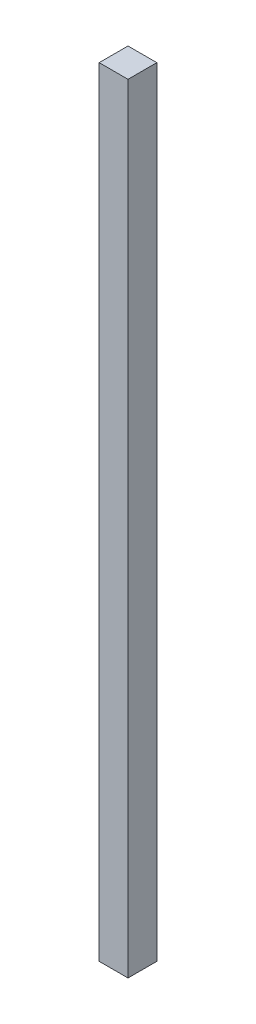
ISO-10303-21;
HEADER;
FILE_DESCRIPTION(('STEP AP214'),'2;1');
FILE_NAME('part.step','',(''),(''),'','','');
FILE_SCHEMA(('AUTOMOTIVE_DESIGN { 1 0 10303 214 1 1 1 1 }'));
ENDSEC;
DATA;
#1=APPLICATION_CONTEXT('core data for automotive mechanical design processes');
#2=APPLICATION_PROTOCOL_DEFINITION('international standard','automotive_design',2000,#1);
#3=PRODUCT_CONTEXT('',#1,'mechanical');
#4=PRODUCT('Part','Part','',(#3));
#5=PRODUCT_RELATED_PRODUCT_CATEGORY('part','',(#4));
#6=PRODUCT_DEFINITION_FORMATION('','',#4);
#7=PRODUCT_DEFINITION_CONTEXT('part definition',#1,'design');
#8=PRODUCT_DEFINITION('design','',#6,#7);
#9=PRODUCT_DEFINITION_SHAPE('','',#8);
#10=(LENGTH_UNIT() NAMED_UNIT(*) SI_UNIT(.MILLI.,.METRE.));
#11=(NAMED_UNIT(*) PLANE_ANGLE_UNIT() SI_UNIT($,.RADIAN.));
#12=(NAMED_UNIT(*) SI_UNIT($,.STERADIAN.) SOLID_ANGLE_UNIT());
#13=UNCERTAINTY_MEASURE_WITH_UNIT(LENGTH_MEASURE(1.E-05),#10,'distance_accuracy_value','');
#14=(GEOMETRIC_REPRESENTATION_CONTEXT(3) GLOBAL_UNCERTAINTY_ASSIGNED_CONTEXT((#13)) GLOBAL_UNIT_ASSIGNED_CONTEXT((#10,
#11,#12)) REPRESENTATION_CONTEXT('',''));
#15=CARTESIAN_POINT('',(0.,0.,0.));
#16=DIRECTION('',(0.,0.,1.));
#17=DIRECTION('',(1.,0.,0.));
#18=AXIS2_PLACEMENT_3D('',#15,#16,#17);
#19=CARTESIAN_POINT('',(0.,685.8,0.));
#20=DIRECTION('',(0.999999999999999,0.,0.));
#21=DIRECTION('',(0.,0.,-0.999999999999999));
#22=AXIS2_PLACEMENT_3D('',#19,#20,#21);
#23=PLANE('',#22);
#24=DIRECTION('',(0.,0.,0.999999999999999));
#25=VECTOR('',#24,1.);
#26=CARTESIAN_POINT('',(0.,0.,0.));
#27=LINE('',#26,#25);
#28=CARTESIAN_POINT('',(0.,8.88178419700125E-13,-25.3999999999994));
#29=VERTEX_POINT('',#28);
#30=CARTESIAN_POINT('',(0.,0.,0.));
#31=VERTEX_POINT('',#30);
#32=EDGE_CURVE('E97',#29,#31,#27,.T.);
#33=ORIENTED_EDGE('',*,*,#32,.T.);
#34=DIRECTION('',(0.,-0.999999999999999,0.));
#35=VECTOR('',#34,1.);
#36=CARTESIAN_POINT('',(0.,685.8,0.));
#37=LINE('',#36,#35);
#38=CARTESIAN_POINT('',(0.,685.8,0.));
#39=VERTEX_POINT('',#38);
#40=EDGE_CURVE('E11',#39,#31,#37,.T.);
#41=ORIENTED_EDGE('',*,*,#40,.F.);
#42=DIRECTION('',(0.,0.,0.999999999999999));
#43=VECTOR('',#42,1.);
#44=CARTESIAN_POINT('',(0.,685.8,0.));
#45=LINE('',#44,#43);
#46=CARTESIAN_POINT('',(0.,685.8,-25.3999999999999));
#47=VERTEX_POINT('',#46);
#48=EDGE_CURVE('E85',#47,#39,#45,.T.);
#49=ORIENTED_EDGE('',*,*,#48,.F.);
#50=DIRECTION('',(0.,-0.999999999999999,0.));
#51=VECTOR('',#50,1.);
#52=CARTESIAN_POINT('',(0.,685.8,-25.3999999999999));
#53=LINE('',#52,#51);
#54=EDGE_CURVE('E93',#47,#29,#53,.T.);
#55=ORIENTED_EDGE('',*,*,#54,.T.);
#56=EDGE_LOOP('',(#33,#41,#49,#55));
#57=FACE_BOUND('',#56,.T.);
#58=ADVANCED_FACE('F34',(#57),#23,.F.);
#59=CARTESIAN_POINT('',(0.,685.8,0.));
#60=DIRECTION('',(0.,0.,-0.999999999999999));
#61=DIRECTION('',(-0.999999999999999,0.,0.));
#62=AXIS2_PLACEMENT_3D('',#59,#60,#61);
#63=PLANE('',#62);
#64=DIRECTION('',(0.999999999999999,0.,0.));
#65=VECTOR('',#64,1.);
#66=CARTESIAN_POINT('',(0.,0.,0.));
#67=LINE('',#66,#65);
#68=CARTESIAN_POINT('',(25.4,0.,0.));
#69=VERTEX_POINT('',#68);
#70=EDGE_CURVE('E89',#31,#69,#67,.T.);
#71=ORIENTED_EDGE('',*,*,#70,.T.);
#72=DIRECTION('',(0.,-0.999999999999999,0.));
#73=VECTOR('',#72,1.);
#74=CARTESIAN_POINT('',(25.4,685.8,0.));
#75=LINE('',#74,#73);
#76=CARTESIAN_POINT('',(25.4,685.8,0.));
#77=VERTEX_POINT('',#76);
#78=EDGE_CURVE('E42',#77,#69,#75,.T.);
#79=ORIENTED_EDGE('',*,*,#78,.F.);
#80=DIRECTION('',(0.999999999999999,0.,0.));
#81=VECTOR('',#80,1.);
#82=CARTESIAN_POINT('',(0.,685.8,0.));
#83=LINE('',#82,#81);
#84=EDGE_CURVE('E80',#39,#77,#83,.T.);
#85=ORIENTED_EDGE('',*,*,#84,.F.);
#86=ORIENTED_EDGE('',*,*,#40,.T.);
#87=EDGE_LOOP('',(#71,#79,#85,#86));
#88=FACE_BOUND('',#87,.T.);
#89=ADVANCED_FACE('F88',(#88),#63,.F.);
#90=CARTESIAN_POINT('',(25.4,685.8,0.));
#91=DIRECTION('',(-0.999999999999999,0.,0.));
#92=DIRECTION('',(0.,0.,0.999999999999999));
#93=AXIS2_PLACEMENT_3D('',#90,#91,#92);
#94=PLANE('',#93);
#95=DIRECTION('',(0.,0.,-0.999999999999999));
#96=VECTOR('',#95,1.);
#97=CARTESIAN_POINT('',(25.4,0.,0.));
#98=LINE('',#97,#96);
#99=CARTESIAN_POINT('',(25.4,8.88178419700125E-13,-25.3999999999994));
#100=VERTEX_POINT('',#99);
#101=EDGE_CURVE('E67',#69,#100,#98,.T.);
#102=ORIENTED_EDGE('',*,*,#101,.T.);
#103=DIRECTION('',(0.,-0.999999999999999,0.));
#104=VECTOR('',#103,1.);
#105=CARTESIAN_POINT('',(25.4,685.8,-25.3999999999999));
#106=LINE('',#105,#104);
#107=CARTESIAN_POINT('',(25.4,685.8,-25.3999999999999));
#108=VERTEX_POINT('',#107);
#109=EDGE_CURVE('E90',#108,#100,#106,.T.);
#110=ORIENTED_EDGE('',*,*,#109,.F.);
#111=DIRECTION('',(0.,0.,-0.999999999999999));
#112=VECTOR('',#111,1.);
#113=CARTESIAN_POINT('',(25.4,685.8,0.));
#114=LINE('',#113,#112);
#115=EDGE_CURVE('E83',#77,#108,#114,.T.);
#116=ORIENTED_EDGE('',*,*,#115,.F.);
#117=ORIENTED_EDGE('',*,*,#78,.T.);
#118=EDGE_LOOP('',(#102,#110,#116,#117));
#119=FACE_BOUND('',#118,.T.);
#120=ADVANCED_FACE('F91',(#119),#94,.F.);
#121=CARTESIAN_POINT('',(0.,685.8,-25.3999999999999));
#122=DIRECTION('',(0.,0.,0.999999999999999));
#123=DIRECTION('',(0.999999999999999,0.,0.));
#124=AXIS2_PLACEMENT_3D('',#121,#122,#123);
#125=PLANE('',#124);
#126=DIRECTION('',(-0.999999999999999,0.,0.));
#127=VECTOR('',#126,1.);
#128=CARTESIAN_POINT('',(0.,8.88178419700125E-13,-25.3999999999994));
#129=LINE('',#128,#127);
#130=EDGE_CURVE('E73',#100,#29,#129,.T.);
#131=ORIENTED_EDGE('',*,*,#130,.T.);
#132=ORIENTED_EDGE('',*,*,#54,.F.);
#133=DIRECTION('',(-0.999999999999999,0.,0.));
#134=VECTOR('',#133,1.);
#135=CARTESIAN_POINT('',(0.,685.8,-25.3999999999999));
#136=LINE('',#135,#134);
#137=EDGE_CURVE('E50',#108,#47,#136,.T.);
#138=ORIENTED_EDGE('',*,*,#137,.F.);
#139=ORIENTED_EDGE('',*,*,#109,.T.);
#140=EDGE_LOOP('',(#131,#132,#138,#139));
#141=FACE_BOUND('',#140,.T.);
#142=ADVANCED_FACE('F104',(#141),#125,.F.);
#143=CARTESIAN_POINT('',(0.,685.8,0.));
#144=DIRECTION('',(0.,-0.999999999999999,0.));
#145=DIRECTION('',(0.,0.,-0.999999999999999));
#146=AXIS2_PLACEMENT_3D('',#143,#144,#145);
#147=PLANE('',#146);
#148=ORIENTED_EDGE('',*,*,#48,.T.);
#149=ORIENTED_EDGE('',*,*,#84,.T.);
#150=ORIENTED_EDGE('',*,*,#115,.T.);
#151=ORIENTED_EDGE('',*,*,#137,.T.);
#152=EDGE_LOOP('',(#148,#149,#150,#151));
#153=FACE_BOUND('',#152,.T.);
#154=ADVANCED_FACE('F81',(#153),#147,.F.);
#155=CARTESIAN_POINT('',(0.,0.,0.));
#156=DIRECTION('',(0.,-0.999999999999999,0.));
#157=DIRECTION('',(0.,0.,-0.999999999999999));
#158=AXIS2_PLACEMENT_3D('',#155,#156,#157);
#159=PLANE('',#158);
#160=ORIENTED_EDGE('',*,*,#32,.F.);
#161=ORIENTED_EDGE('',*,*,#130,.F.);
#162=ORIENTED_EDGE('',*,*,#101,.F.);
#163=ORIENTED_EDGE('',*,*,#70,.F.);
#164=EDGE_LOOP('',(#160,#161,#162,#163));
#165=FACE_BOUND('',#164,.T.);
#166=ADVANCED_FACE('F107',(#165),#159,.T.);
#167=CLOSED_SHELL('',(#58,#89,#120,#142,#154,#166));
#168=MANIFOLD_SOLID_BREP('B2',#167);
#169=ADVANCED_BREP_SHAPE_REPRESENTATION('',(#18,#168),#14);
#170=SHAPE_DEFINITION_REPRESENTATION(#9,#169);
ENDSEC;
END-ISO-10303-21;
